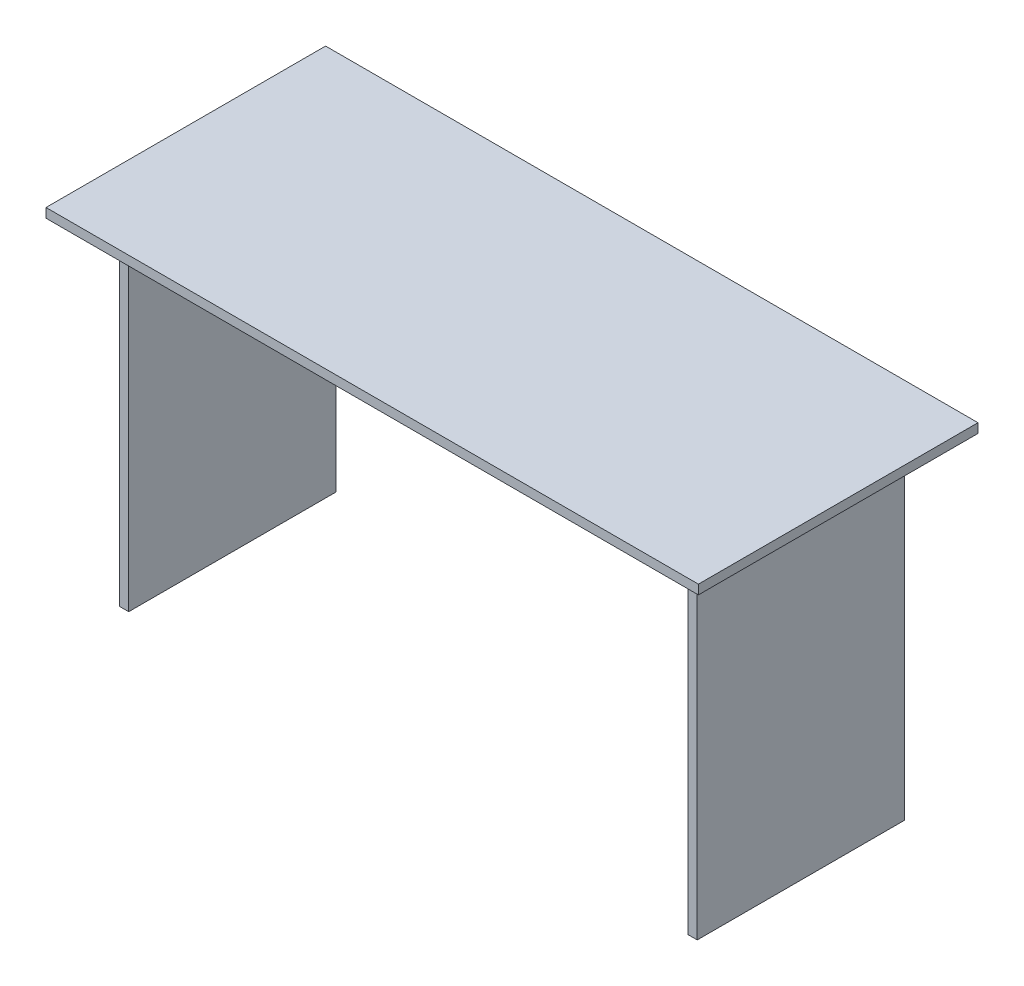
ISO-10303-21;
HEADER;
FILE_DESCRIPTION(('STEP AP214'),'2;1');
FILE_NAME('part.step','',(''),(''),'','','');
FILE_SCHEMA(('AUTOMOTIVE_DESIGN { 1 0 10303 214 1 1 1 1 }'));
ENDSEC;
DATA;
#1=APPLICATION_CONTEXT('core data for automotive mechanical design processes');
#2=APPLICATION_PROTOCOL_DEFINITION('international standard','automotive_design',2000,#1);
#3=PRODUCT_CONTEXT('',#1,'mechanical');
#4=PRODUCT('Part','Part','',(#3));
#5=PRODUCT_RELATED_PRODUCT_CATEGORY('part','',(#4));
#6=PRODUCT_DEFINITION_FORMATION('','',#4);
#7=PRODUCT_DEFINITION_CONTEXT('part definition',#1,'design');
#8=PRODUCT_DEFINITION('design','',#6,#7);
#9=PRODUCT_DEFINITION_SHAPE('','',#8);
#10=(LENGTH_UNIT() NAMED_UNIT(*) SI_UNIT(.MILLI.,.METRE.));
#11=(NAMED_UNIT(*) PLANE_ANGLE_UNIT() SI_UNIT($,.RADIAN.));
#12=(NAMED_UNIT(*) SI_UNIT($,.STERADIAN.) SOLID_ANGLE_UNIT());
#13=UNCERTAINTY_MEASURE_WITH_UNIT(LENGTH_MEASURE(1.E-05),#10,'distance_accuracy_value','');
#14=(GEOMETRIC_REPRESENTATION_CONTEXT(3) GLOBAL_UNCERTAINTY_ASSIGNED_CONTEXT((#13)) GLOBAL_UNIT_ASSIGNED_CONTEXT((#10,
#11,#12)) REPRESENTATION_CONTEXT('',''));
#15=CARTESIAN_POINT('',(0.,0.,0.));
#16=DIRECTION('',(0.,0.,1.));
#17=DIRECTION('',(1.,0.,0.));
#18=AXIS2_PLACEMENT_3D('',#15,#16,#17);
#19=CARTESIAN_POINT('',(0.,-20.,0.));
#20=DIRECTION('',(0.,1.,0.));
#21=DIRECTION('',(0.,0.,1.));
#22=AXIS2_PLACEMENT_3D('',#19,#20,#21);
#23=PLANE('',#22);
#24=DIRECTION('',(1.,0.,0.));
#25=VECTOR('',#24,1.);
#26=CARTESIAN_POINT('',(-600.,-20.,27.5000000000002));
#27=LINE('',#26,#25);
#28=CARTESIAN_POINT('',(-600.,-20.,27.5000000000002));
#29=VERTEX_POINT('',#28);
#30=CARTESIAN_POINT('',(600.,-20.,27.5000000000001));
#31=VERTEX_POINT('',#30);
#32=EDGE_CURVE('E623',#29,#31,#27,.T.);
#33=ORIENTED_EDGE('',*,*,#32,.F.);
#34=DIRECTION('',(0.,0.,1.));
#35=VECTOR('',#34,1.);
#36=CARTESIAN_POINT('',(-600.,-20.,222.5));
#37=LINE('',#36,#35);
#38=CARTESIAN_POINT('',(-600.,-20.,-27.5000000000001));
#39=VERTEX_POINT('',#38);
#40=EDGE_CURVE('E210',#39,#29,#37,.T.);
#41=ORIENTED_EDGE('',*,*,#40,.F.);
#42=DIRECTION('',(-1.,0.,0.));
#43=VECTOR('',#42,1.);
#44=CARTESIAN_POINT('',(-600.,-20.,-27.5000000000002));
#45=LINE('',#44,#43);
#46=CARTESIAN_POINT('',(600.,-20.,-27.5000000000001));
#47=VERTEX_POINT('',#46);
#48=EDGE_CURVE('E211',#47,#39,#45,.T.);
#49=ORIENTED_EDGE('',*,*,#48,.F.);
#50=DIRECTION('',(0.,0.,-1.));
#51=VECTOR('',#50,1.);
#52=CARTESIAN_POINT('',(600.,-20.,222.5));
#53=LINE('',#52,#51);
#54=EDGE_CURVE('E310',#31,#47,#53,.T.);
#55=ORIENTED_EDGE('',*,*,#54,.F.);
#56=EDGE_LOOP('',(#33,#41,#49,#55));
#57=FACE_BOUND('',#56,.T.);
#58=ADVANCED_FACE('F37',(#57),#23,.F.);
#59=DIRECTION('',(0.,0.,1.));
#60=VECTOR('',#59,1.);
#61=CARTESIAN_POINT('',(-700.,-20.,300.));
#62=LINE('',#61,#60);
#63=CARTESIAN_POINT('',(-700.,-20.,-300.));
#64=VERTEX_POINT('',#63);
#65=CARTESIAN_POINT('',(-700.,-20.,300.));
#66=VERTEX_POINT('',#65);
#67=EDGE_CURVE('E325',#64,#66,#62,.T.);
#68=ORIENTED_EDGE('',*,*,#67,.F.);
#69=DIRECTION('',(-1.,0.,0.));
#70=VECTOR('',#69,1.);
#71=CARTESIAN_POINT('',(700.,-20.,-300.));
#72=LINE('',#71,#70);
#73=CARTESIAN_POINT('',(700.,-20.,-300.));
#74=VERTEX_POINT('',#73);
#75=EDGE_CURVE('E335',#74,#64,#72,.T.);
#76=ORIENTED_EDGE('',*,*,#75,.F.);
#77=DIRECTION('',(0.,0.,-1.));
#78=VECTOR('',#77,1.);
#79=CARTESIAN_POINT('',(700.,-20.,300.));
#80=LINE('',#79,#78);
#81=CARTESIAN_POINT('',(700.,-20.,300.));
#82=VERTEX_POINT('',#81);
#83=EDGE_CURVE('E332',#82,#74,#80,.T.);
#84=ORIENTED_EDGE('',*,*,#83,.F.);
#85=DIRECTION('',(1.,0.,0.));
#86=VECTOR('',#85,1.);
#87=CARTESIAN_POINT('',(700.,-20.,300.));
#88=LINE('',#87,#86);
#89=EDGE_CURVE('E328',#66,#82,#88,.T.);
#90=ORIENTED_EDGE('',*,*,#89,.F.);
#91=EDGE_LOOP('',(#68,#76,#84,#90));
#92=FACE_BOUND('',#91,.T.);
#93=DIRECTION('',(-1.,0.,0.));
#94=VECTOR('',#93,1.);
#95=CARTESIAN_POINT('',(-600.,-20.,177.5));
#96=LINE('',#95,#94);
#97=CARTESIAN_POINT('',(600.,-20.,177.5));
#98=VERTEX_POINT('',#97);
#99=CARTESIAN_POINT('',(-600.,-20.,177.5));
#100=VERTEX_POINT('',#99);
#101=EDGE_CURVE('E205',#98,#100,#96,.T.);
#102=ORIENTED_EDGE('',*,*,#101,.F.);
#103=CARTESIAN_POINT('',(600.,-20.,222.5));
#104=VERTEX_POINT('',#103);
#105=EDGE_CURVE('E307',#104,#98,#53,.T.);
#106=ORIENTED_EDGE('',*,*,#105,.F.);
#107=DIRECTION('',(-1.,0.,0.));
#108=VECTOR('',#107,1.);
#109=CARTESIAN_POINT('',(600.,-20.,222.5));
#110=LINE('',#109,#108);
#111=CARTESIAN_POINT('',(620.,-20.,222.5));
#112=VERTEX_POINT('',#111);
#113=EDGE_CURVE('E303',#112,#104,#110,.T.);
#114=ORIENTED_EDGE('',*,*,#113,.F.);
#115=DIRECTION('',(0.,0.,1.));
#116=VECTOR('',#115,1.);
#117=CARTESIAN_POINT('',(620.,-20.,222.5));
#118=LINE('',#117,#116);
#119=CARTESIAN_POINT('',(620.,-20.,-222.5));
#120=VERTEX_POINT('',#119);
#121=EDGE_CURVE('E289',#120,#112,#118,.T.);
#122=ORIENTED_EDGE('',*,*,#121,.F.);
#123=DIRECTION('',(1.,0.,0.));
#124=VECTOR('',#123,1.);
#125=CARTESIAN_POINT('',(600.,-20.,-222.5));
#126=LINE('',#125,#124);
#127=CARTESIAN_POINT('',(600.,-20.,-222.5));
#128=VERTEX_POINT('',#127);
#129=EDGE_CURVE('E294',#128,#120,#126,.T.);
#130=ORIENTED_EDGE('',*,*,#129,.F.);
#131=CARTESIAN_POINT('',(600.,-20.,-197.5));
#132=VERTEX_POINT('',#131);
#133=EDGE_CURVE('E306',#132,#128,#53,.T.);
#134=ORIENTED_EDGE('',*,*,#133,.F.);
#135=DIRECTION('',(1.,0.,0.));
#136=VECTOR('',#135,1.);
#137=CARTESIAN_POINT('',(600.,-20.,-197.5));
#138=LINE('',#137,#136);
#139=CARTESIAN_POINT('',(-600.,-20.,-197.5));
#140=VERTEX_POINT('',#139);
#141=EDGE_CURVE('E233',#140,#132,#138,.T.);
#142=ORIENTED_EDGE('',*,*,#141,.F.);
#143=CARTESIAN_POINT('',(-600.,-20.,-222.5));
#144=VERTEX_POINT('',#143);
#145=EDGE_CURVE('E267',#144,#140,#37,.T.);
#146=ORIENTED_EDGE('',*,*,#145,.F.);
#147=DIRECTION('',(1.,0.,0.));
#148=VECTOR('',#147,1.);
#149=CARTESIAN_POINT('',(-600.,-20.,-222.5));
#150=LINE('',#149,#148);
#151=CARTESIAN_POINT('',(-620.,-20.,-222.5));
#152=VERTEX_POINT('',#151);
#153=EDGE_CURVE('E260',#152,#144,#150,.T.);
#154=ORIENTED_EDGE('',*,*,#153,.F.);
#155=DIRECTION('',(0.,0.,-1.));
#156=VECTOR('',#155,1.);
#157=CARTESIAN_POINT('',(-620.,-20.,222.5));
#158=LINE('',#157,#156);
#159=CARTESIAN_POINT('',(-620.,-20.,222.5));
#160=VERTEX_POINT('',#159);
#161=EDGE_CURVE('E273',#160,#152,#158,.T.);
#162=ORIENTED_EDGE('',*,*,#161,.F.);
#163=DIRECTION('',(-1.,0.,0.));
#164=VECTOR('',#163,1.);
#165=CARTESIAN_POINT('',(-600.,-20.,222.5));
#166=LINE('',#165,#164);
#167=CARTESIAN_POINT('',(-600.,-20.,222.5));
#168=VERTEX_POINT('',#167);
#169=EDGE_CURVE('E270',#168,#160,#166,.T.);
#170=ORIENTED_EDGE('',*,*,#169,.F.);
#171=EDGE_CURVE('E255',#100,#168,#37,.T.);
#172=ORIENTED_EDGE('',*,*,#171,.F.);
#173=EDGE_LOOP('',(#102,#106,#114,#122,#130,#134,#142,#146,#154,#162,#170,#172));
#174=FACE_BOUND('',#173,.T.);
#175=ADVANCED_FACE('F364',(#92,#174),#23,.F.);
#176=CARTESIAN_POINT('',(600.,-740.,222.5));
#177=DIRECTION('',(1.,0.,0.));
#178=DIRECTION('',(0.,0.,-1.));
#179=AXIS2_PLACEMENT_3D('',#176,#177,#178);
#180=PLANE('',#179);
#181=DIRECTION('',(0.,1.,0.));
#182=VECTOR('',#181,1.);
#183=CARTESIAN_POINT('',(600.,-40.,27.5000000000001));
#184=LINE('',#183,#182);
#185=CARTESIAN_POINT('',(600.,-40.,27.5000000000001));
#186=VERTEX_POINT('',#185);
#187=EDGE_CURVE('E195',#186,#31,#184,.T.);
#188=ORIENTED_EDGE('',*,*,#187,.T.);
#189=ORIENTED_EDGE('',*,*,#54,.T.);
#190=DIRECTION('',(0.,1.,0.));
#191=VECTOR('',#190,1.);
#192=CARTESIAN_POINT('',(600.,-40.,-27.5000000000002));
#193=LINE('',#192,#191);
#194=CARTESIAN_POINT('',(600.,-40.,-27.5000000000001));
#195=VERTEX_POINT('',#194);
#196=EDGE_CURVE('E62',#195,#47,#193,.T.);
#197=ORIENTED_EDGE('',*,*,#196,.F.);
#198=DIRECTION('',(0.,0.,1.));
#199=VECTOR('',#198,1.);
#200=CARTESIAN_POINT('',(600.,-40.,-177.5));
#201=LINE('',#200,#199);
#202=CARTESIAN_POINT('',(600.,-40.,-177.5));
#203=VERTEX_POINT('',#202);
#204=EDGE_CURVE('E225',#203,#195,#201,.T.);
#205=ORIENTED_EDGE('',*,*,#204,.F.);
#206=DIRECTION('',(0.,1.,0.));
#207=VECTOR('',#206,1.);
#208=CARTESIAN_POINT('',(600.,-470.,-177.5));
#209=LINE('',#208,#207);
#210=CARTESIAN_POINT('',(600.,-470.,-177.5));
#211=VERTEX_POINT('',#210);
#212=EDGE_CURVE('E248',#211,#203,#209,.T.);
#213=ORIENTED_EDGE('',*,*,#212,.F.);
#214=DIRECTION('',(0.,0.,1.));
#215=VECTOR('',#214,1.);
#216=CARTESIAN_POINT('',(600.,-470.,-197.5));
#217=LINE('',#216,#215);
#218=CARTESIAN_POINT('',(600.,-470.,-197.5));
#219=VERTEX_POINT('',#218);
#220=EDGE_CURVE('E239',#219,#211,#217,.T.);
#221=ORIENTED_EDGE('',*,*,#220,.F.);
#222=DIRECTION('',(0.,1.,0.));
#223=VECTOR('',#222,1.);
#224=CARTESIAN_POINT('',(600.,-470.,-197.5));
#225=LINE('',#224,#223);
#226=EDGE_CURVE('E250',#219,#132,#225,.T.);
#227=ORIENTED_EDGE('',*,*,#226,.T.);
#228=ORIENTED_EDGE('',*,*,#133,.T.);
#229=DIRECTION('',(0.,1.,0.));
#230=VECTOR('',#229,1.);
#231=CARTESIAN_POINT('',(600.,-740.,-222.5));
#232=LINE('',#231,#230);
#233=CARTESIAN_POINT('',(600.,-740.,-222.5));
#234=VERTEX_POINT('',#233);
#235=EDGE_CURVE('E315',#234,#128,#232,.T.);
#236=ORIENTED_EDGE('',*,*,#235,.F.);
#237=DIRECTION('',(0.,0.,-1.));
#238=VECTOR('',#237,1.);
#239=CARTESIAN_POINT('',(600.,-740.,222.5));
#240=LINE('',#239,#238);
#241=CARTESIAN_POINT('',(600.,-740.,222.5));
#242=VERTEX_POINT('',#241);
#243=EDGE_CURVE('E296',#242,#234,#240,.T.);
#244=ORIENTED_EDGE('',*,*,#243,.F.);
#245=DIRECTION('',(0.,1.,0.));
#246=VECTOR('',#245,1.);
#247=CARTESIAN_POINT('',(600.,-740.,222.5));
#248=LINE('',#247,#246);
#249=EDGE_CURVE('E318',#242,#104,#248,.T.);
#250=ORIENTED_EDGE('',*,*,#249,.T.);
#251=ORIENTED_EDGE('',*,*,#105,.T.);
#252=DIRECTION('',(0.,1.,0.));
#253=VECTOR('',#252,1.);
#254=CARTESIAN_POINT('',(600.,-40.,177.5));
#255=LINE('',#254,#253);
#256=CARTESIAN_POINT('',(600.,-40.,177.5));
#257=VERTEX_POINT('',#256);
#258=EDGE_CURVE('E216',#257,#98,#255,.T.);
#259=ORIENTED_EDGE('',*,*,#258,.F.);
#260=DIRECTION('',(0.,0.,1.));
#261=VECTOR('',#260,1.);
#262=CARTESIAN_POINT('',(600.,-40.,177.5));
#263=LINE('',#262,#261);
#264=EDGE_CURVE('E198',#186,#257,#263,.T.);
#265=ORIENTED_EDGE('',*,*,#264,.F.);
#266=EDGE_LOOP('',(#188,#189,#197,#205,#213,#221,#227,#228,#236,#244,#250,#251,#259,#265));
#267=FACE_BOUND('',#266,.T.);
#268=ADVANCED_FACE('F382',(#267),#180,.F.);
#269=CARTESIAN_POINT('',(-600.,-740.,222.5));
#270=DIRECTION('',(-1.,0.,0.));
#271=DIRECTION('',(0.,0.,1.));
#272=AXIS2_PLACEMENT_3D('',#269,#270,#271);
#273=PLANE('',#272);
#274=DIRECTION('',(0.,1.,0.));
#275=VECTOR('',#274,1.);
#276=CARTESIAN_POINT('',(-600.,-40.,27.5000000000002));
#277=LINE('',#276,#275);
#278=CARTESIAN_POINT('',(-600.,-40.,27.5000000000002));
#279=VERTEX_POINT('',#278);
#280=EDGE_CURVE('E192',#279,#29,#277,.T.);
#281=ORIENTED_EDGE('',*,*,#280,.F.);
#282=DIRECTION('',(0.,0.,-1.));
#283=VECTOR('',#282,1.);
#284=CARTESIAN_POINT('',(-600.,-40.,177.5));
#285=LINE('',#284,#283);
#286=CARTESIAN_POINT('',(-600.,-40.,177.5));
#287=VERTEX_POINT('',#286);
#288=EDGE_CURVE('E199',#287,#279,#285,.T.);
#289=ORIENTED_EDGE('',*,*,#288,.F.);
#290=DIRECTION('',(0.,1.,0.));
#291=VECTOR('',#290,1.);
#292=CARTESIAN_POINT('',(-600.,-40.,177.5));
#293=LINE('',#292,#291);
#294=EDGE_CURVE('E54',#287,#100,#293,.T.);
#295=ORIENTED_EDGE('',*,*,#294,.T.);
#296=ORIENTED_EDGE('',*,*,#171,.T.);
#297=DIRECTION('',(0.,1.,0.));
#298=VECTOR('',#297,1.);
#299=CARTESIAN_POINT('',(-600.,-740.,222.5));
#300=LINE('',#299,#298);
#301=CARTESIAN_POINT('',(-600.,-740.,222.5));
#302=VERTEX_POINT('',#301);
#303=EDGE_CURVE('E286',#302,#168,#300,.T.);
#304=ORIENTED_EDGE('',*,*,#303,.F.);
#305=DIRECTION('',(0.,0.,1.));
#306=VECTOR('',#305,1.);
#307=CARTESIAN_POINT('',(-600.,-740.,222.5));
#308=LINE('',#307,#306);
#309=CARTESIAN_POINT('',(-600.,-740.,-222.5));
#310=VERTEX_POINT('',#309);
#311=EDGE_CURVE('E256',#310,#302,#308,.T.);
#312=ORIENTED_EDGE('',*,*,#311,.F.);
#313=DIRECTION('',(0.,1.,0.));
#314=VECTOR('',#313,1.);
#315=CARTESIAN_POINT('',(-600.,-740.,-222.5));
#316=LINE('',#315,#314);
#317=EDGE_CURVE('E266',#310,#144,#316,.T.);
#318=ORIENTED_EDGE('',*,*,#317,.T.);
#319=ORIENTED_EDGE('',*,*,#145,.T.);
#320=DIRECTION('',(0.,1.,0.));
#321=VECTOR('',#320,1.);
#322=CARTESIAN_POINT('',(-600.,-470.,-197.5));
#323=LINE('',#322,#321);
#324=CARTESIAN_POINT('',(-600.,-470.,-197.5));
#325=VERTEX_POINT('',#324);
#326=EDGE_CURVE('E253',#325,#140,#323,.T.);
#327=ORIENTED_EDGE('',*,*,#326,.F.);
#328=DIRECTION('',(0.,0.,-1.));
#329=VECTOR('',#328,1.);
#330=CARTESIAN_POINT('',(-600.,-470.,-197.5));
#331=LINE('',#330,#329);
#332=CARTESIAN_POINT('',(-600.,-470.,-177.5));
#333=VERTEX_POINT('',#332);
#334=EDGE_CURVE('E234',#333,#325,#331,.T.);
#335=ORIENTED_EDGE('',*,*,#334,.F.);
#336=DIRECTION('',(0.,1.,0.));
#337=VECTOR('',#336,1.);
#338=CARTESIAN_POINT('',(-600.,-470.,-177.5));
#339=LINE('',#338,#337);
#340=CARTESIAN_POINT('',(-600.,-40.,-177.5));
#341=VERTEX_POINT('',#340);
#342=EDGE_CURVE('E244',#333,#341,#339,.T.);
#343=ORIENTED_EDGE('',*,*,#342,.T.);
#344=DIRECTION('',(0.,0.,-1.));
#345=VECTOR('',#344,1.);
#346=CARTESIAN_POINT('',(-600.,-40.,-177.5));
#347=LINE('',#346,#345);
#348=CARTESIAN_POINT('',(-600.,-40.,-27.5000000000001));
#349=VERTEX_POINT('',#348);
#350=EDGE_CURVE('E214',#349,#341,#347,.T.);
#351=ORIENTED_EDGE('',*,*,#350,.F.);
#352=DIRECTION('',(0.,1.,0.));
#353=VECTOR('',#352,1.);
#354=CARTESIAN_POINT('',(-600.,-40.,-27.5000000000002));
#355=LINE('',#354,#353);
#356=EDGE_CURVE('E229',#349,#39,#355,.T.);
#357=ORIENTED_EDGE('',*,*,#356,.T.);
#358=ORIENTED_EDGE('',*,*,#40,.T.);
#359=EDGE_LOOP('',(#281,#289,#295,#296,#304,#312,#318,#319,#327,#335,#343,#351,#357,#358));
#360=FACE_BOUND('',#359,.T.);
#361=ADVANCED_FACE('F208',(#360),#273,.F.);
#362=CARTESIAN_POINT('',(600.,-470.,-177.5));
#363=DIRECTION('',(0.,0.,-1.));
#364=DIRECTION('',(-1.,0.,0.));
#365=AXIS2_PLACEMENT_3D('',#362,#363,#364);
#366=PLANE('',#365);
#367=DIRECTION('',(1.,0.,0.));
#368=VECTOR('',#367,1.);
#369=CARTESIAN_POINT('',(-600.,-40.,-177.5));
#370=LINE('',#369,#368);
#371=EDGE_CURVE('E222',#341,#203,#370,.T.);
#372=ORIENTED_EDGE('',*,*,#371,.F.);
#373=ORIENTED_EDGE('',*,*,#342,.F.);
#374=DIRECTION('',(-1.,0.,0.));
#375=VECTOR('',#374,1.);
#376=CARTESIAN_POINT('',(600.,-470.,-177.5));
#377=LINE('',#376,#375);
#378=EDGE_CURVE('E241',#211,#333,#377,.T.);
#379=ORIENTED_EDGE('',*,*,#378,.F.);
#380=ORIENTED_EDGE('',*,*,#212,.T.);
#381=EDGE_LOOP('',(#372,#373,#379,#380));
#382=FACE_BOUND('',#381,.T.);
#383=ADVANCED_FACE('F422',(#382),#366,.F.);
#384=CARTESIAN_POINT('',(-700.,-20.,300.));
#385=DIRECTION('',(-1.,0.,0.));
#386=DIRECTION('',(0.,0.,1.));
#387=AXIS2_PLACEMENT_3D('',#384,#385,#386);
#388=PLANE('',#387);
#389=DIRECTION('',(0.,0.,1.));
#390=VECTOR('',#389,1.);
#391=CARTESIAN_POINT('',(-700.,0.,300.));
#392=LINE('',#391,#390);
#393=CARTESIAN_POINT('',(-700.,0.,-300.));
#394=VERTEX_POINT('',#393);
#395=CARTESIAN_POINT('',(-700.,0.,300.));
#396=VERTEX_POINT('',#395);
#397=EDGE_CURVE('E324',#394,#396,#392,.T.);
#398=ORIENTED_EDGE('',*,*,#397,.F.);
#399=DIRECTION('',(0.,1.,0.));
#400=VECTOR('',#399,1.);
#401=CARTESIAN_POINT('',(-700.,-20.,-300.));
#402=LINE('',#401,#400);
#403=EDGE_CURVE('E11',#64,#394,#402,.T.);
#404=ORIENTED_EDGE('',*,*,#403,.F.);
#405=ORIENTED_EDGE('',*,*,#67,.T.);
#406=DIRECTION('',(0.,1.,0.));
#407=VECTOR('',#406,1.);
#408=CARTESIAN_POINT('',(-700.,-20.,300.));
#409=LINE('',#408,#407);
#410=EDGE_CURVE('E41',#66,#396,#409,.T.);
#411=ORIENTED_EDGE('',*,*,#410,.T.);
#412=EDGE_LOOP('',(#398,#404,#405,#411));
#413=FACE_BOUND('',#412,.T.);
#414=ADVANCED_FACE('F39',(#413),#388,.T.);
#415=CARTESIAN_POINT('',(700.,-20.,-300.));
#416=DIRECTION('',(0.,0.,-1.));
#417=DIRECTION('',(-1.,0.,0.));
#418=AXIS2_PLACEMENT_3D('',#415,#416,#417);
#419=PLANE('',#418);
#420=DIRECTION('',(-1.,0.,0.));
#421=VECTOR('',#420,1.);
#422=CARTESIAN_POINT('',(700.,0.,-300.));
#423=LINE('',#422,#421);
#424=CARTESIAN_POINT('',(700.,0.,-300.));
#425=VERTEX_POINT('',#424);
#426=EDGE_CURVE('E329',#425,#394,#423,.T.);
#427=ORIENTED_EDGE('',*,*,#426,.F.);
#428=DIRECTION('',(0.,1.,0.));
#429=VECTOR('',#428,1.);
#430=CARTESIAN_POINT('',(700.,-20.,-300.));
#431=LINE('',#430,#429);
#432=EDGE_CURVE('E46',#74,#425,#431,.T.);
#433=ORIENTED_EDGE('',*,*,#432,.F.);
#434=ORIENTED_EDGE('',*,*,#75,.T.);
#435=ORIENTED_EDGE('',*,*,#403,.T.);
#436=EDGE_LOOP('',(#427,#433,#434,#435));
#437=FACE_BOUND('',#436,.T.);
#438=ADVANCED_FACE('F361',(#437),#419,.T.);
#439=CARTESIAN_POINT('',(700.,-20.,300.));
#440=DIRECTION('',(1.,0.,0.));
#441=DIRECTION('',(0.,0.,-1.));
#442=AXIS2_PLACEMENT_3D('',#439,#440,#441);
#443=PLANE('',#442);
#444=DIRECTION('',(0.,0.,-1.));
#445=VECTOR('',#444,1.);
#446=CARTESIAN_POINT('',(700.,0.,300.));
#447=LINE('',#446,#445);
#448=CARTESIAN_POINT('',(700.,0.,300.));
#449=VERTEX_POINT('',#448);
#450=EDGE_CURVE('E343',#449,#425,#447,.T.);
#451=ORIENTED_EDGE('',*,*,#450,.F.);
#452=DIRECTION('',(0.,1.,0.));
#453=VECTOR('',#452,1.);
#454=CARTESIAN_POINT('',(700.,-20.,300.));
#455=LINE('',#454,#453);
#456=EDGE_CURVE('E348',#82,#449,#455,.T.);
#457=ORIENTED_EDGE('',*,*,#456,.F.);
#458=ORIENTED_EDGE('',*,*,#83,.T.);
#459=ORIENTED_EDGE('',*,*,#432,.T.);
#460=EDGE_LOOP('',(#451,#457,#458,#459));
#461=FACE_BOUND('',#460,.T.);
#462=ADVANCED_FACE('F368',(#461),#443,.T.);
#463=CARTESIAN_POINT('',(700.,-20.,300.));
#464=DIRECTION('',(0.,0.,1.));
#465=DIRECTION('',(1.,0.,0.));
#466=AXIS2_PLACEMENT_3D('',#463,#464,#465);
#467=PLANE('',#466);
#468=DIRECTION('',(1.,0.,0.));
#469=VECTOR('',#468,1.);
#470=CARTESIAN_POINT('',(700.,0.,300.));
#471=LINE('',#470,#469);
#472=EDGE_CURVE('E340',#396,#449,#471,.T.);
#473=ORIENTED_EDGE('',*,*,#472,.F.);
#474=ORIENTED_EDGE('',*,*,#410,.F.);
#475=ORIENTED_EDGE('',*,*,#89,.T.);
#476=ORIENTED_EDGE('',*,*,#456,.T.);
#477=EDGE_LOOP('',(#473,#474,#475,#476));
#478=FACE_BOUND('',#477,.T.);
#479=ADVANCED_FACE('F356',(#478),#467,.T.);
#480=CARTESIAN_POINT('',(0.,0.,0.));
#481=DIRECTION('',(0.,1.,0.));
#482=DIRECTION('',(0.,0.,1.));
#483=AXIS2_PLACEMENT_3D('',#480,#481,#482);
#484=PLANE('',#483);
#485=ORIENTED_EDGE('',*,*,#397,.T.);
#486=ORIENTED_EDGE('',*,*,#472,.T.);
#487=ORIENTED_EDGE('',*,*,#450,.T.);
#488=ORIENTED_EDGE('',*,*,#426,.T.);
#489=EDGE_LOOP('',(#485,#486,#487,#488));
#490=FACE_BOUND('',#489,.T.);
#491=ADVANCED_FACE('F358',(#490),#484,.T.);
#492=CARTESIAN_POINT('',(620.,-740.,222.5));
#493=DIRECTION('',(-1.,0.,0.));
#494=DIRECTION('',(0.,0.,1.));
#495=AXIS2_PLACEMENT_3D('',#492,#493,#494);
#496=PLANE('',#495);
#497=ORIENTED_EDGE('',*,*,#121,.T.);
#498=DIRECTION('',(0.,1.,0.));
#499=VECTOR('',#498,1.);
#500=CARTESIAN_POINT('',(620.,-740.,222.5));
#501=LINE('',#500,#499);
#502=CARTESIAN_POINT('',(620.,-740.,222.5));
#503=VERTEX_POINT('',#502);
#504=EDGE_CURVE('E321',#503,#112,#501,.T.);
#505=ORIENTED_EDGE('',*,*,#504,.F.);
#506=DIRECTION('',(0.,0.,1.));
#507=VECTOR('',#506,1.);
#508=CARTESIAN_POINT('',(620.,-740.,222.5));
#509=LINE('',#508,#507);
#510=CARTESIAN_POINT('',(620.,-740.,-222.5));
#511=VERTEX_POINT('',#510);
#512=EDGE_CURVE('E290',#511,#503,#509,.T.);
#513=ORIENTED_EDGE('',*,*,#512,.F.);
#514=DIRECTION('',(0.,1.,0.));
#515=VECTOR('',#514,1.);
#516=CARTESIAN_POINT('',(620.,-740.,-222.5));
#517=LINE('',#516,#515);
#518=EDGE_CURVE('E300',#511,#120,#517,.T.);
#519=ORIENTED_EDGE('',*,*,#518,.T.);
#520=EDGE_LOOP('',(#497,#505,#513,#519));
#521=FACE_BOUND('',#520,.T.);
#522=ADVANCED_FACE('F385',(#521),#496,.F.);
#523=CARTESIAN_POINT('',(600.,-740.,222.5));
#524=DIRECTION('',(0.,0.,-1.));
#525=DIRECTION('',(-1.,0.,0.));
#526=AXIS2_PLACEMENT_3D('',#523,#524,#525);
#527=PLANE('',#526);
#528=ORIENTED_EDGE('',*,*,#113,.T.);
#529=ORIENTED_EDGE('',*,*,#249,.F.);
#530=DIRECTION('',(-1.,0.,0.));
#531=VECTOR('',#530,1.);
#532=CARTESIAN_POINT('',(600.,-740.,222.5));
#533=LINE('',#532,#531);
#534=EDGE_CURVE('E293',#503,#242,#533,.T.);
#535=ORIENTED_EDGE('',*,*,#534,.F.);
#536=ORIENTED_EDGE('',*,*,#504,.T.);
#537=EDGE_LOOP('',(#528,#529,#535,#536));
#538=FACE_BOUND('',#537,.T.);
#539=ADVANCED_FACE('F391',(#538),#527,.F.);
#540=CARTESIAN_POINT('',(600.,-740.,-222.5));
#541=DIRECTION('',(0.,0.,1.));
#542=DIRECTION('',(1.,0.,0.));
#543=AXIS2_PLACEMENT_3D('',#540,#541,#542);
#544=PLANE('',#543);
#545=ORIENTED_EDGE('',*,*,#129,.T.);
#546=ORIENTED_EDGE('',*,*,#518,.F.);
#547=DIRECTION('',(1.,0.,0.));
#548=VECTOR('',#547,1.);
#549=CARTESIAN_POINT('',(600.,-740.,-222.5));
#550=LINE('',#549,#548);
#551=EDGE_CURVE('E298',#234,#511,#550,.T.);
#552=ORIENTED_EDGE('',*,*,#551,.F.);
#553=ORIENTED_EDGE('',*,*,#235,.T.);
#554=EDGE_LOOP('',(#545,#546,#552,#553));
#555=FACE_BOUND('',#554,.T.);
#556=ADVANCED_FACE('F396',(#555),#544,.F.);
#557=CARTESIAN_POINT('',(0.,-740.,0.));
#558=DIRECTION('',(0.,-1.,0.));
#559=DIRECTION('',(0.,0.,-1.));
#560=AXIS2_PLACEMENT_3D('',#557,#558,#559);
#561=PLANE('',#560);
#562=ORIENTED_EDGE('',*,*,#512,.T.);
#563=ORIENTED_EDGE('',*,*,#534,.T.);
#564=ORIENTED_EDGE('',*,*,#243,.T.);
#565=ORIENTED_EDGE('',*,*,#551,.T.);
#566=EDGE_LOOP('',(#562,#563,#564,#565));
#567=FACE_BOUND('',#566,.T.);
#568=ADVANCED_FACE('F447',(#567),#561,.T.);
#569=CARTESIAN_POINT('',(-600.,-740.,222.5));
#570=DIRECTION('',(0.,0.,-1.));
#571=DIRECTION('',(-1.,0.,0.));
#572=AXIS2_PLACEMENT_3D('',#569,#570,#571);
#573=PLANE('',#572);
#574=ORIENTED_EDGE('',*,*,#169,.T.);
#575=DIRECTION('',(0.,1.,0.));
#576=VECTOR('',#575,1.);
#577=CARTESIAN_POINT('',(-620.,-740.,222.5));
#578=LINE('',#577,#576);
#579=CARTESIAN_POINT('',(-620.,-740.,222.5));
#580=VERTEX_POINT('',#579);
#581=EDGE_CURVE('E283',#580,#160,#578,.T.);
#582=ORIENTED_EDGE('',*,*,#581,.F.);
#583=DIRECTION('',(-1.,0.,0.));
#584=VECTOR('',#583,1.);
#585=CARTESIAN_POINT('',(-600.,-740.,222.5));
#586=LINE('',#585,#584);
#587=EDGE_CURVE('E259',#302,#580,#586,.T.);
#588=ORIENTED_EDGE('',*,*,#587,.F.);
#589=ORIENTED_EDGE('',*,*,#303,.T.);
#590=EDGE_LOOP('',(#574,#582,#588,#589));
#591=FACE_BOUND('',#590,.T.);
#592=ADVANCED_FACE('F445',(#591),#573,.F.);
#593=CARTESIAN_POINT('',(-620.,-740.,222.5));
#594=DIRECTION('',(1.,0.,0.));
#595=DIRECTION('',(0.,0.,-1.));
#596=AXIS2_PLACEMENT_3D('',#593,#594,#595);
#597=PLANE('',#596);
#598=ORIENTED_EDGE('',*,*,#161,.T.);
#599=DIRECTION('',(0.,1.,0.));
#600=VECTOR('',#599,1.);
#601=CARTESIAN_POINT('',(-620.,-740.,-222.5));
#602=LINE('',#601,#600);
#603=CARTESIAN_POINT('',(-620.,-740.,-222.5));
#604=VERTEX_POINT('',#603);
#605=EDGE_CURVE('E280',#604,#152,#602,.T.);
#606=ORIENTED_EDGE('',*,*,#605,.F.);
#607=DIRECTION('',(0.,0.,-1.));
#608=VECTOR('',#607,1.);
#609=CARTESIAN_POINT('',(-620.,-740.,222.5));
#610=LINE('',#609,#608);
#611=EDGE_CURVE('E262',#580,#604,#610,.T.);
#612=ORIENTED_EDGE('',*,*,#611,.F.);
#613=ORIENTED_EDGE('',*,*,#581,.T.);
#614=EDGE_LOOP('',(#598,#606,#612,#613));
#615=FACE_BOUND('',#614,.T.);
#616=ADVANCED_FACE('F441',(#615),#597,.F.);
#617=CARTESIAN_POINT('',(-600.,-740.,-222.5));
#618=DIRECTION('',(0.,0.,1.));
#619=DIRECTION('',(1.,0.,0.));
#620=AXIS2_PLACEMENT_3D('',#617,#618,#619);
#621=PLANE('',#620);
#622=ORIENTED_EDGE('',*,*,#153,.T.);
#623=ORIENTED_EDGE('',*,*,#317,.F.);
#624=DIRECTION('',(1.,0.,0.));
#625=VECTOR('',#624,1.);
#626=CARTESIAN_POINT('',(-600.,-740.,-222.5));
#627=LINE('',#626,#625);
#628=EDGE_CURVE('E264',#604,#310,#627,.T.);
#629=ORIENTED_EDGE('',*,*,#628,.F.);
#630=ORIENTED_EDGE('',*,*,#605,.T.);
#631=EDGE_LOOP('',(#622,#623,#629,#630));
#632=FACE_BOUND('',#631,.T.);
#633=ADVANCED_FACE('F431',(#632),#621,.F.);
#634=CARTESIAN_POINT('',(0.,-740.,0.));
#635=DIRECTION('',(0.,1.,0.));
#636=DIRECTION('',(0.,0.,1.));
#637=AXIS2_PLACEMENT_3D('',#634,#635,#636);
#638=PLANE('',#637);
#639=ORIENTED_EDGE('',*,*,#311,.T.);
#640=ORIENTED_EDGE('',*,*,#587,.T.);
#641=ORIENTED_EDGE('',*,*,#611,.T.);
#642=ORIENTED_EDGE('',*,*,#628,.T.);
#643=EDGE_LOOP('',(#639,#640,#641,#642));
#644=FACE_BOUND('',#643,.T.);
#645=ADVANCED_FACE('F437',(#644),#638,.F.);
#646=CARTESIAN_POINT('',(600.,-470.,-197.5));
#647=DIRECTION('',(0.,0.,1.));
#648=DIRECTION('',(1.,0.,0.));
#649=AXIS2_PLACEMENT_3D('',#646,#647,#648);
#650=PLANE('',#649);
#651=ORIENTED_EDGE('',*,*,#141,.T.);
#652=ORIENTED_EDGE('',*,*,#226,.F.);
#653=DIRECTION('',(1.,0.,0.));
#654=VECTOR('',#653,1.);
#655=CARTESIAN_POINT('',(600.,-470.,-197.5));
#656=LINE('',#655,#654);
#657=EDGE_CURVE('E237',#325,#219,#656,.T.);
#658=ORIENTED_EDGE('',*,*,#657,.F.);
#659=ORIENTED_EDGE('',*,*,#326,.T.);
#660=EDGE_LOOP('',(#651,#652,#658,#659));
#661=FACE_BOUND('',#660,.T.);
#662=ADVANCED_FACE('F428',(#661),#650,.F.);
#663=CARTESIAN_POINT('',(0.,-470.,0.));
#664=DIRECTION('',(0.,-1.,0.));
#665=DIRECTION('',(0.,0.,-1.));
#666=AXIS2_PLACEMENT_3D('',#663,#664,#665);
#667=PLANE('',#666);
#668=ORIENTED_EDGE('',*,*,#334,.T.);
#669=ORIENTED_EDGE('',*,*,#657,.T.);
#670=ORIENTED_EDGE('',*,*,#220,.T.);
#671=ORIENTED_EDGE('',*,*,#378,.T.);
#672=EDGE_LOOP('',(#668,#669,#670,#671));
#673=FACE_BOUND('',#672,.T.);
#674=ADVANCED_FACE('F425',(#673),#667,.T.);
#675=CARTESIAN_POINT('',(-600.,-40.,-27.5000000000002));
#676=DIRECTION('',(0.,0.,-1.));
#677=DIRECTION('',(-1.,0.,0.));
#678=AXIS2_PLACEMENT_3D('',#675,#676,#677);
#679=PLANE('',#678);
#680=ORIENTED_EDGE('',*,*,#48,.T.);
#681=ORIENTED_EDGE('',*,*,#356,.F.);
#682=DIRECTION('',(-1.,0.,0.));
#683=VECTOR('',#682,1.);
#684=CARTESIAN_POINT('',(-600.,-40.,-27.5000000000002));
#685=LINE('',#684,#683);
#686=EDGE_CURVE('E227',#195,#349,#685,.T.);
#687=ORIENTED_EDGE('',*,*,#686,.F.);
#688=ORIENTED_EDGE('',*,*,#196,.T.);
#689=EDGE_LOOP('',(#680,#681,#687,#688));
#690=FACE_BOUND('',#689,.T.);
#691=ADVANCED_FACE('F416',(#690),#679,.F.);
#692=CARTESIAN_POINT('',(0.,-40.,0.));
#693=DIRECTION('',(0.,1.,0.));
#694=DIRECTION('',(0.,0.,1.));
#695=AXIS2_PLACEMENT_3D('',#692,#693,#694);
#696=PLANE('',#695);
#697=ORIENTED_EDGE('',*,*,#350,.T.);
#698=ORIENTED_EDGE('',*,*,#371,.T.);
#699=ORIENTED_EDGE('',*,*,#204,.T.);
#700=ORIENTED_EDGE('',*,*,#686,.T.);
#701=EDGE_LOOP('',(#697,#698,#699,#700));
#702=FACE_BOUND('',#701,.T.);
#703=ADVANCED_FACE('F418',(#702),#696,.F.);
#704=CARTESIAN_POINT('',(-600.,-40.,27.5000000000002));
#705=DIRECTION('',(0.,0.,1.));
#706=DIRECTION('',(1.,0.,0.));
#707=AXIS2_PLACEMENT_3D('',#704,#705,#706);
#708=PLANE('',#707);
#709=ORIENTED_EDGE('',*,*,#32,.T.);
#710=ORIENTED_EDGE('',*,*,#187,.F.);
#711=DIRECTION('',(1.,0.,0.));
#712=VECTOR('',#711,1.);
#713=CARTESIAN_POINT('',(-600.,-40.,27.5000000000002));
#714=LINE('',#713,#712);
#715=EDGE_CURVE('E188',#279,#186,#714,.T.);
#716=ORIENTED_EDGE('',*,*,#715,.F.);
#717=ORIENTED_EDGE('',*,*,#280,.T.);
#718=EDGE_LOOP('',(#709,#710,#716,#717));
#719=FACE_BOUND('',#718,.T.);
#720=ADVANCED_FACE('F190',(#719),#708,.F.);
#721=CARTESIAN_POINT('',(-600.,-40.,177.5));
#722=DIRECTION('',(0.,0.,-1.));
#723=DIRECTION('',(-1.,0.,0.));
#724=AXIS2_PLACEMENT_3D('',#721,#722,#723);
#725=PLANE('',#724);
#726=ORIENTED_EDGE('',*,*,#101,.T.);
#727=ORIENTED_EDGE('',*,*,#294,.F.);
#728=DIRECTION('',(-1.,0.,0.));
#729=VECTOR('',#728,1.);
#730=CARTESIAN_POINT('',(-600.,-40.,177.5));
#731=LINE('',#730,#729);
#732=EDGE_CURVE('E203',#257,#287,#731,.T.);
#733=ORIENTED_EDGE('',*,*,#732,.F.);
#734=ORIENTED_EDGE('',*,*,#258,.T.);
#735=EDGE_LOOP('',(#726,#727,#733,#734));
#736=FACE_BOUND('',#735,.T.);
#737=ADVANCED_FACE('F601',(#736),#725,.F.);
#738=CARTESIAN_POINT('',(0.,-40.,0.));
#739=DIRECTION('',(0.,-1.,0.));
#740=DIRECTION('',(0.,0.,-1.));
#741=AXIS2_PLACEMENT_3D('',#738,#739,#740);
#742=PLANE('',#741);
#743=ORIENTED_EDGE('',*,*,#288,.T.);
#744=ORIENTED_EDGE('',*,*,#715,.T.);
#745=ORIENTED_EDGE('',*,*,#264,.T.);
#746=ORIENTED_EDGE('',*,*,#732,.T.);
#747=EDGE_LOOP('',(#743,#744,#745,#746));
#748=FACE_BOUND('',#747,.T.);
#749=ADVANCED_FACE('F202',(#748),#742,.T.);
#750=CLOSED_SHELL('',(#58,#175,#268,#361,#383,#414,#438,#462,#479,#491,#522,#539,#556,#568,#592,
#616,#633,#645,#662,#674,#691,#703,#720,#737,#749));
#751=MANIFOLD_SOLID_BREP('B2',#750);
#752=ADVANCED_BREP_SHAPE_REPRESENTATION('',(#18,#751),#14);
#753=SHAPE_DEFINITION_REPRESENTATION(#9,#752);
ENDSEC;
END-ISO-10303-21;
